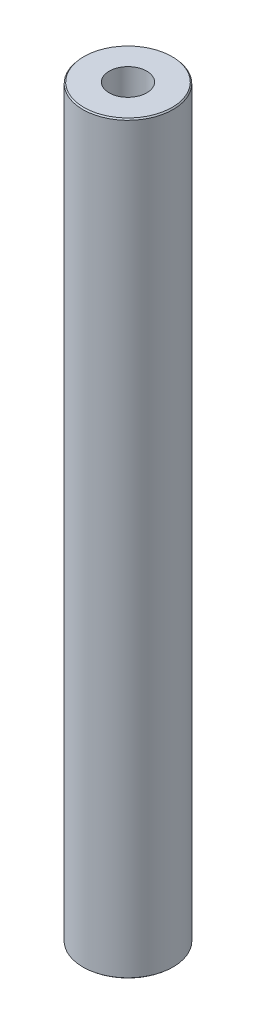
ISO-10303-21;
HEADER;
FILE_DESCRIPTION(('STEP AP214'),'2;1');
FILE_NAME('part.step','',(''),(''),'','','');
FILE_SCHEMA(('AUTOMOTIVE_DESIGN { 1 0 10303 214 1 1 1 1 }'));
ENDSEC;
DATA;
#1=APPLICATION_CONTEXT('core data for automotive mechanical design processes');
#2=APPLICATION_PROTOCOL_DEFINITION('international standard','automotive_design',2000,#1);
#3=PRODUCT_CONTEXT('',#1,'mechanical');
#4=PRODUCT('Part','Part','',(#3));
#5=PRODUCT_RELATED_PRODUCT_CATEGORY('part','',(#4));
#6=PRODUCT_DEFINITION_FORMATION('','',#4);
#7=PRODUCT_DEFINITION_CONTEXT('part definition',#1,'design');
#8=PRODUCT_DEFINITION('design','',#6,#7);
#9=PRODUCT_DEFINITION_SHAPE('','',#8);
#10=(LENGTH_UNIT() NAMED_UNIT(*) SI_UNIT(.MILLI.,.METRE.));
#11=(NAMED_UNIT(*) PLANE_ANGLE_UNIT() SI_UNIT($,.RADIAN.));
#12=(NAMED_UNIT(*) SI_UNIT($,.STERADIAN.) SOLID_ANGLE_UNIT());
#13=UNCERTAINTY_MEASURE_WITH_UNIT(LENGTH_MEASURE(1.E-05),#10,'distance_accuracy_value','');
#14=(GEOMETRIC_REPRESENTATION_CONTEXT(3) GLOBAL_UNCERTAINTY_ASSIGNED_CONTEXT((#13)) GLOBAL_UNIT_ASSIGNED_CONTEXT((#10,
#11,#12)) REPRESENTATION_CONTEXT('',''));
#15=CARTESIAN_POINT('',(0.,0.,0.));
#16=DIRECTION('',(0.,0.,1.));
#17=DIRECTION('',(1.,0.,0.));
#18=AXIS2_PLACEMENT_3D('',#15,#16,#17);
#19=CARTESIAN_POINT('',(0.,330.012456133773,0.));
#20=DIRECTION('',(0.,-1.,0.));
#21=DIRECTION('',(0.,0.,-1.));
#22=AXIS2_PLACEMENT_3D('',#19,#20,#21);
#23=CYLINDRICAL_SURFACE('',#22,20.);
#24=CARTESIAN_POINT('',(0.,329.444382663071,0.));
#25=DIRECTION('',(0.,1.,0.));
#26=DIRECTION('',(0.,0.,1.));
#27=AXIS2_PLACEMENT_3D('',#24,#25,#26);
#28=CIRCLE('',#27,20.);
#29=CARTESIAN_POINT('',(0.,329.444382663071,20.));
#30=VERTEX_POINT('',#29);
#31=EDGE_CURVE('E50',#30,#30,#28,.F.);
#32=ORIENTED_EDGE('',*,*,#31,.T.);
#33=EDGE_LOOP('',(#32));
#34=FACE_BOUND('',#33,.T.);
#35=CARTESIAN_POINT('',(0.,0.47518910751021,0.));
#36=DIRECTION('',(0.,1.,0.));
#37=DIRECTION('',(0.,0.,1.));
#38=AXIS2_PLACEMENT_3D('',#35,#36,#37);
#39=CIRCLE('',#38,20.);
#40=CARTESIAN_POINT('',(0.,0.47518910751021,20.));
#41=VERTEX_POINT('',#40);
#42=EDGE_CURVE('E51',#41,#41,#39,.T.);
#43=ORIENTED_EDGE('',*,*,#42,.T.);
#44=EDGE_LOOP('',(#43));
#45=FACE_BOUND('',#44,.T.);
#46=ADVANCED_FACE('F39',(#34,#45),#23,.T.);
#47=CARTESIAN_POINT('',(0.,330.012456133773,0.));
#48=DIRECTION('',(0.,1.,0.));
#49=DIRECTION('',(0.,0.,1.));
#50=AXIS2_PLACEMENT_3D('',#47,#48,#49);
#51=PLANE('',#50);
#52=CARTESIAN_POINT('',(0.,330.012456133773,0.));
#53=DIRECTION('',(0.,1.,0.));
#54=DIRECTION('',(0.,0.,1.));
#55=AXIS2_PLACEMENT_3D('',#52,#53,#54);
#56=CIRCLE('',#55,19.5248108924899);
#57=CARTESIAN_POINT('',(0.,330.012456133773,19.5248108924899));
#58=VERTEX_POINT('',#57);
#59=EDGE_CURVE('E54',#58,#58,#56,.T.);
#60=ORIENTED_EDGE('',*,*,#59,.T.);
#61=EDGE_LOOP('',(#60));
#62=FACE_BOUND('',#61,.T.);
#63=CARTESIAN_POINT('',(0.,330.012456133773,0.));
#64=DIRECTION('',(0.,1.,0.));
#65=DIRECTION('',(0.,0.,1.));
#66=AXIS2_PLACEMENT_3D('',#63,#64,#65);
#67=CIRCLE('',#66,8.33609647537914);
#68=CARTESIAN_POINT('',(0.,330.012456133773,8.33609647537914));
#69=VERTEX_POINT('',#68);
#70=EDGE_CURVE('E58',#69,#69,#67,.T.);
#71=ORIENTED_EDGE('',*,*,#70,.F.);
#72=EDGE_LOOP('',(#71));
#73=FACE_BOUND('',#72,.T.);
#74=ADVANCED_FACE('F69',(#62,#73),#51,.T.);
#75=CARTESIAN_POINT('',(0.,0.,0.));
#76=DIRECTION('',(0.,1.,0.));
#77=DIRECTION('',(0.,0.,1.));
#78=AXIS2_PLACEMENT_3D('',#75,#76,#77);
#79=PLANE('',#78);
#80=CARTESIAN_POINT('',(0.,0.,0.));
#81=DIRECTION('',(0.,1.,0.));
#82=DIRECTION('',(0.,0.,1.));
#83=AXIS2_PLACEMENT_3D('',#80,#81,#82);
#84=CIRCLE('',#83,19.4319265292982);
#85=CARTESIAN_POINT('',(0.,0.,19.4319265292982));
#86=VERTEX_POINT('',#85);
#87=EDGE_CURVE('E10',#86,#86,#84,.F.);
#88=ORIENTED_EDGE('',*,*,#87,.T.);
#89=EDGE_LOOP('',(#88));
#90=FACE_BOUND('',#89,.T.);
#91=CARTESIAN_POINT('',(0.,0.,0.));
#92=DIRECTION('',(0.,1.,0.));
#93=DIRECTION('',(0.,0.,1.));
#94=AXIS2_PLACEMENT_3D('',#91,#92,#93);
#95=CIRCLE('',#94,8.33609647537914);
#96=CARTESIAN_POINT('',(0.,0.,8.33609647537914));
#97=VERTEX_POINT('',#96);
#98=EDGE_CURVE('E63',#97,#97,#95,.T.);
#99=ORIENTED_EDGE('',*,*,#98,.T.);
#100=EDGE_LOOP('',(#99));
#101=FACE_BOUND('',#100,.T.);
#102=ADVANCED_FACE('F75',(#90,#101),#79,.F.);
#103=CARTESIAN_POINT('',(0.,330.012456133773,0.));
#104=DIRECTION('',(0.,-1.,0.));
#105=DIRECTION('',(0.,0.,-1.));
#106=AXIS2_PLACEMENT_3D('',#103,#104,#105);
#107=CYLINDRICAL_SURFACE('',#106,8.33609647537914);
#108=ORIENTED_EDGE('',*,*,#70,.T.);
#109=EDGE_LOOP('',(#108));
#110=FACE_BOUND('',#109,.T.);
#111=ORIENTED_EDGE('',*,*,#98,.F.);
#112=EDGE_LOOP('',(#111));
#113=FACE_BOUND('',#112,.T.);
#114=ADVANCED_FACE('F70',(#110,#113),#107,.F.);
#115=CARTESIAN_POINT('',(0.,330.012456133773,0.));
#116=DIRECTION('',(0.,-1.,0.));
#117=DIRECTION('',(0.,0.,-1.));
#118=AXIS2_PLACEMENT_3D('',#115,#116,#117);
#119=CONICAL_SURFACE('',#118,19.5248108924899,0.696599714634983);
#120=ORIENTED_EDGE('',*,*,#31,.F.);
#121=EDGE_LOOP('',(#120));
#122=FACE_BOUND('',#121,.T.);
#123=ORIENTED_EDGE('',*,*,#59,.F.);
#124=EDGE_LOOP('',(#123));
#125=FACE_BOUND('',#124,.T.);
#126=ADVANCED_FACE('F81',(#122,#125),#119,.T.);
#127=CARTESIAN_POINT('',(0.,0.47518910751021,0.));
#128=DIRECTION('',(0.,1.,0.));
#129=DIRECTION('',(0.,0.,1.));
#130=AXIS2_PLACEMENT_3D('',#127,#128,#129);
#131=CONICAL_SURFACE('',#130,20.,0.874196612159837);
#132=ORIENTED_EDGE('',*,*,#87,.F.);
#133=EDGE_LOOP('',(#132));
#134=FACE_BOUND('',#133,.T.);
#135=ORIENTED_EDGE('',*,*,#42,.F.);
#136=EDGE_LOOP('',(#135));
#137=FACE_BOUND('',#136,.T.);
#138=ADVANCED_FACE('F45',(#134,#137),#131,.T.);
#139=CLOSED_SHELL('',(#46,#74,#102,#114,#126,#138));
#140=MANIFOLD_SOLID_BREP('B2',#139);
#141=ADVANCED_BREP_SHAPE_REPRESENTATION('',(#18,#140),#14);
#142=SHAPE_DEFINITION_REPRESENTATION(#9,#141);
ENDSEC;
END-ISO-10303-21;
